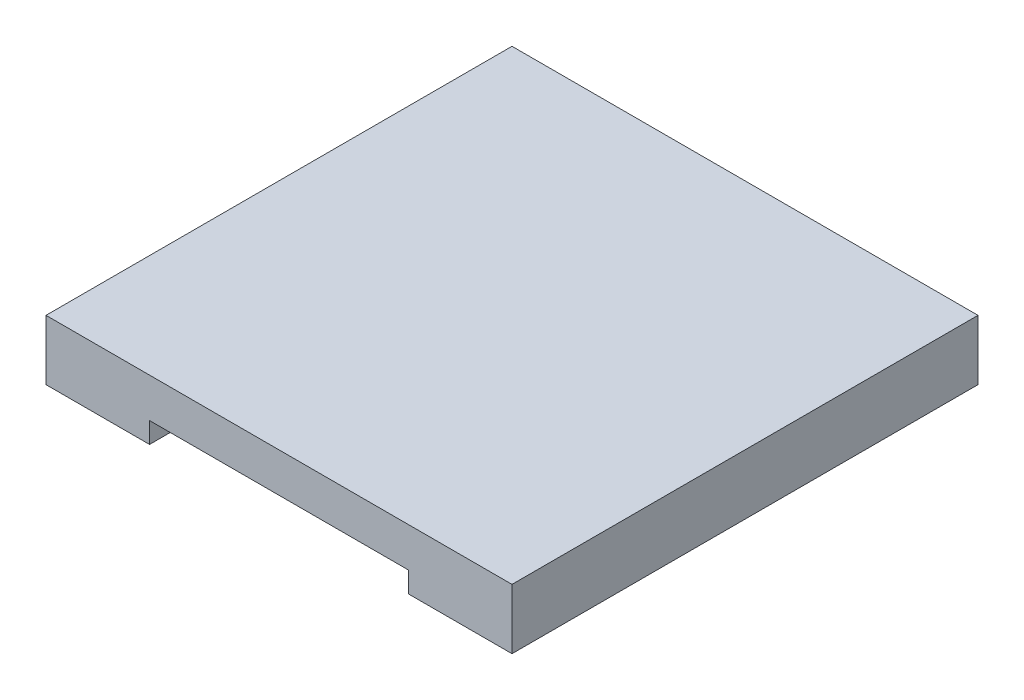
ISO-10303-21;
HEADER;
FILE_DESCRIPTION(('STEP AP214'),'2;1');
FILE_NAME('part.step','',(''),(''),'','','');
FILE_SCHEMA(('AUTOMOTIVE_DESIGN { 1 0 10303 214 1 1 1 1 }'));
ENDSEC;
DATA;
#1=APPLICATION_CONTEXT('core data for automotive mechanical design processes');
#2=APPLICATION_PROTOCOL_DEFINITION('international standard','automotive_design',2000,#1);
#3=PRODUCT_CONTEXT('',#1,'mechanical');
#4=PRODUCT('Part','Part','',(#3));
#5=PRODUCT_RELATED_PRODUCT_CATEGORY('part','',(#4));
#6=PRODUCT_DEFINITION_FORMATION('','',#4);
#7=PRODUCT_DEFINITION_CONTEXT('part definition',#1,'design');
#8=PRODUCT_DEFINITION('design','',#6,#7);
#9=PRODUCT_DEFINITION_SHAPE('','',#8);
#10=(LENGTH_UNIT() NAMED_UNIT(*) SI_UNIT(.MILLI.,.METRE.));
#11=(NAMED_UNIT(*) PLANE_ANGLE_UNIT() SI_UNIT($,.RADIAN.));
#12=(NAMED_UNIT(*) SI_UNIT($,.STERADIAN.) SOLID_ANGLE_UNIT());
#13=UNCERTAINTY_MEASURE_WITH_UNIT(LENGTH_MEASURE(1.E-05),#10,'distance_accuracy_value','');
#14=(GEOMETRIC_REPRESENTATION_CONTEXT(3) GLOBAL_UNCERTAINTY_ASSIGNED_CONTEXT((#13)) GLOBAL_UNIT_ASSIGNED_CONTEXT((#10,
#11,#12)) REPRESENTATION_CONTEXT('',''));
#15=CARTESIAN_POINT('',(0.,0.,0.));
#16=DIRECTION('',(0.,0.,1.));
#17=DIRECTION('',(1.,0.,0.));
#18=AXIS2_PLACEMENT_3D('',#15,#16,#17);
#19=CARTESIAN_POINT('',(0.,79.,0.));
#20=DIRECTION('',(0.,1.,0.));
#21=DIRECTION('',(0.,0.,1.));
#22=AXIS2_PLACEMENT_3D('',#19,#20,#21);
#23=PLANE('',#22);
#24=DIRECTION('',(-1.,0.,0.));
#25=VECTOR('',#24,1.);
#26=CARTESIAN_POINT('',(-45.,79.,-45.));
#27=LINE('',#26,#25);
#28=CARTESIAN_POINT('',(7.49999999999999,79.,-45.));
#29=VERTEX_POINT('',#28);
#30=CARTESIAN_POINT('',(-7.50000000000001,79.,-45.));
#31=VERTEX_POINT('',#30);
#32=EDGE_CURVE('E217',#29,#31,#27,.T.);
#33=ORIENTED_EDGE('',*,*,#32,.F.);
#34=DIRECTION('',(0.,0.,-1.));
#35=VECTOR('',#34,1.);
#36=CARTESIAN_POINT('',(7.49999999999999,79.,-45.));
#37=LINE('',#36,#35);
#38=CARTESIAN_POINT('',(7.49999999999999,79.,-27.2));
#39=VERTEX_POINT('',#38);
#40=EDGE_CURVE('E11',#39,#29,#37,.T.);
#41=ORIENTED_EDGE('',*,*,#40,.F.);
#42=DIRECTION('',(-1.,0.,0.));
#43=VECTOR('',#42,1.);
#44=CARTESIAN_POINT('',(45.,79.,-27.2));
#45=LINE('',#44,#43);
#46=CARTESIAN_POINT('',(-7.50000000000001,79.,-27.2));
#47=VERTEX_POINT('',#46);
#48=EDGE_CURVE('E215',#39,#47,#45,.T.);
#49=ORIENTED_EDGE('',*,*,#48,.T.);
#50=DIRECTION('',(0.,0.,1.));
#51=VECTOR('',#50,1.);
#52=CARTESIAN_POINT('',(-7.50000000000001,79.,-45.));
#53=LINE('',#52,#51);
#54=EDGE_CURVE('E225',#31,#47,#53,.T.);
#55=ORIENTED_EDGE('',*,*,#54,.F.);
#56=EDGE_LOOP('',(#33,#41,#49,#55));
#57=FACE_BOUND('',#56,.T.);
#58=DIRECTION('',(0.,0.,1.));
#59=VECTOR('',#58,1.);
#60=CARTESIAN_POINT('',(4.09999999999999,79.,-41.75));
#61=LINE('',#60,#59);
#62=CARTESIAN_POINT('',(4.09999999999999,79.,-41.75));
#63=VERTEX_POINT('',#62);
#64=CARTESIAN_POINT('',(4.09999999999999,79.,-30.45));
#65=VERTEX_POINT('',#64);
#66=EDGE_CURVE('E55',#63,#65,#61,.T.);
#67=ORIENTED_EDGE('',*,*,#66,.F.);
#68=DIRECTION('',(1.,0.,0.));
#69=VECTOR('',#68,1.);
#70=CARTESIAN_POINT('',(4.09999999999999,79.,-41.75));
#71=LINE('',#70,#69);
#72=CARTESIAN_POINT('',(-4.1,79.,-41.75));
#73=VERTEX_POINT('',#72);
#74=EDGE_CURVE('E59',#73,#63,#71,.T.);
#75=ORIENTED_EDGE('',*,*,#74,.F.);
#76=DIRECTION('',(0.,0.,-1.));
#77=VECTOR('',#76,1.);
#78=CARTESIAN_POINT('',(-4.1,79.,-41.75));
#79=LINE('',#78,#77);
#80=CARTESIAN_POINT('',(-4.1,79.,-30.45));
#81=VERTEX_POINT('',#80);
#82=EDGE_CURVE('E684',#81,#73,#79,.T.);
#83=ORIENTED_EDGE('',*,*,#82,.F.);
#84=DIRECTION('',(-1.,0.,0.));
#85=VECTOR('',#84,1.);
#86=CARTESIAN_POINT('',(4.09999999999999,79.,-30.45));
#87=LINE('',#86,#85);
#88=EDGE_CURVE('E690',#65,#81,#87,.T.);
#89=ORIENTED_EDGE('',*,*,#88,.F.);
#90=EDGE_LOOP('',(#67,#75,#83,#89));
#91=FACE_BOUND('',#90,.T.);
#92=ADVANCED_FACE('F40',(#57,#91),#23,.F.);
#93=CARTESIAN_POINT('',(0.,91.4,0.));
#94=DIRECTION('',(0.,1.,0.));
#95=DIRECTION('',(0.,0.,1.));
#96=AXIS2_PLACEMENT_3D('',#93,#94,#95);
#97=PLANE('',#96);
#98=DIRECTION('',(1.,0.,0.));
#99=VECTOR('',#98,1.);
#100=CARTESIAN_POINT('',(45.,91.4,-25.2));
#101=LINE('',#100,#99);
#102=CARTESIAN_POINT('',(25.,91.4,-25.2));
#103=VERTEX_POINT('',#102);
#104=CARTESIAN_POINT('',(25.7966933112238,91.4,-25.2));
#105=VERTEX_POINT('',#104);
#106=EDGE_CURVE('E343',#103,#105,#101,.T.);
#107=ORIENTED_EDGE('',*,*,#106,.T.);
#108=DIRECTION('',(0.,0.,1.));
#109=VECTOR('',#108,1.);
#110=CARTESIAN_POINT('',(25.7966933112238,91.4,-45.));
#111=LINE('',#110,#109);
#112=CARTESIAN_POINT('',(25.7966933112238,91.4,-45.));
#113=VERTEX_POINT('',#112);
#114=EDGE_CURVE('E312',#105,#113,#111,.F.);
#115=ORIENTED_EDGE('',*,*,#114,.T.);
#116=DIRECTION('',(-1.,0.,0.));
#117=VECTOR('',#116,1.);
#118=CARTESIAN_POINT('',(-45.,91.4,-45.));
#119=LINE('',#118,#117);
#120=CARTESIAN_POINT('',(45.,91.4,-45.));
#121=VERTEX_POINT('',#120);
#122=EDGE_CURVE('E250',#121,#113,#119,.T.);
#123=ORIENTED_EDGE('',*,*,#122,.F.);
#124=DIRECTION('',(0.,0.,-1.));
#125=VECTOR('',#124,1.);
#126=CARTESIAN_POINT('',(45.,91.4,-45.));
#127=LINE('',#126,#125);
#128=CARTESIAN_POINT('',(45.,91.4,45.));
#129=VERTEX_POINT('',#128);
#130=EDGE_CURVE('E263',#129,#121,#127,.T.);
#131=ORIENTED_EDGE('',*,*,#130,.F.);
#132=DIRECTION('',(1.,0.,0.));
#133=VECTOR('',#132,1.);
#134=CARTESIAN_POINT('',(-45.,91.4,45.));
#135=LINE('',#134,#133);
#136=CARTESIAN_POINT('',(25.,91.4,45.));
#137=VERTEX_POINT('',#136);
#138=EDGE_CURVE('E259',#137,#129,#135,.T.);
#139=ORIENTED_EDGE('',*,*,#138,.F.);
#140=DIRECTION('',(0.,0.,1.));
#141=VECTOR('',#140,1.);
#142=CARTESIAN_POINT('',(25.,91.4,-27.2));
#143=LINE('',#142,#141);
#144=EDGE_CURVE('E243',#103,#137,#143,.T.);
#145=ORIENTED_EDGE('',*,*,#144,.F.);
#146=EDGE_LOOP('',(#107,#115,#123,#131,#139,#145));
#147=FACE_BOUND('',#146,.T.);
#148=ADVANCED_FACE('F401',(#147),#97,.F.);
#149=CARTESIAN_POINT('',(-45.,4.,-45.));
#150=DIRECTION('',(0.,0.,1.));
#151=DIRECTION('',(1.,0.,0.));
#152=AXIS2_PLACEMENT_3D('',#149,#150,#151);
#153=PLANE('',#152);
#154=DIRECTION('',(0.,-1.,0.));
#155=VECTOR('',#154,1.);
#156=CARTESIAN_POINT('',(7.49999999999999,91.4,-45.));
#157=LINE('',#156,#155);
#158=CARTESIAN_POINT('',(7.49999999999999,79.6590323935863,-45.));
#159=VERTEX_POINT('',#158);
#160=EDGE_CURVE('E282',#159,#29,#157,.T.);
#161=ORIENTED_EDGE('',*,*,#160,.T.);
#162=ORIENTED_EDGE('',*,*,#32,.T.);
#163=DIRECTION('',(0.,-1.,0.));
#164=VECTOR('',#163,1.);
#165=CARTESIAN_POINT('',(-7.50000000000001,91.4,-45.));
#166=LINE('',#165,#164);
#167=CARTESIAN_POINT('',(-7.50000000000001,79.6590323935863,-45.));
#168=VERTEX_POINT('',#167);
#169=EDGE_CURVE('E279',#168,#31,#166,.T.);
#170=ORIENTED_EDGE('',*,*,#169,.F.);
#171=CARTESIAN_POINT('',(-10.5,79.6590323935863,-45.));
#172=DIRECTION('',(0.,0.,1.));
#173=DIRECTION('',(1.,0.,0.));
#174=AXIS2_PLACEMENT_3D('',#171,#172,#173);
#175=CIRCLE('',#174,3.);
#176=CARTESIAN_POINT('',(-9.01158318492949,82.2637618199597,-45.));
#177=VERTEX_POINT('',#176);
#178=EDGE_CURVE('E324',#168,#177,#175,.T.);
#179=ORIENTED_EDGE('',*,*,#178,.T.);
#180=DIRECTION('',(0.868243142124459,-0.496138938356835,0.));
#181=VECTOR('',#180,1.);
#182=CARTESIAN_POINT('',(-2.42769230769218,78.5015384615384,-45.));
#183=LINE('',#182,#181);
#184=CARTESIAN_POINT('',(-24.3082764961533,91.0047294263734,-45.));
#185=VERTEX_POINT('',#184);
#186=EDGE_CURVE('E293',#177,#185,#183,.F.);
#187=ORIENTED_EDGE('',*,*,#186,.T.);
#188=CARTESIAN_POINT('',(-25.7966933112238,88.4,-45.));
#189=DIRECTION('',(0.,0.,1.));
#190=DIRECTION('',(1.,0.,0.));
#191=AXIS2_PLACEMENT_3D('',#188,#189,#190);
#192=CIRCLE('',#191,3.);
#193=CARTESIAN_POINT('',(-25.7966933112238,91.4,-45.));
#194=VERTEX_POINT('',#193);
#195=EDGE_CURVE('E322',#185,#194,#192,.T.);
#196=ORIENTED_EDGE('',*,*,#195,.T.);
#197=CARTESIAN_POINT('',(-45.,91.4,-45.));
#198=VERTEX_POINT('',#197);
#199=EDGE_CURVE('E265',#194,#198,#119,.T.);
#200=ORIENTED_EDGE('',*,*,#199,.T.);
#201=DIRECTION('',(0.,-1.,0.));
#202=VECTOR('',#201,1.);
#203=CARTESIAN_POINT('',(-45.,103.,-45.));
#204=LINE('',#203,#202);
#205=CARTESIAN_POINT('',(-45.,103.,-45.));
#206=VERTEX_POINT('',#205);
#207=EDGE_CURVE('E256',#206,#198,#204,.T.);
#208=ORIENTED_EDGE('',*,*,#207,.F.);
#209=DIRECTION('',(-1.,0.,0.));
#210=VECTOR('',#209,1.);
#211=CARTESIAN_POINT('',(-45.,103.,-45.));
#212=LINE('',#211,#210);
#213=CARTESIAN_POINT('',(45.,103.,-45.));
#214=VERTEX_POINT('',#213);
#215=EDGE_CURVE('E254',#214,#206,#212,.T.);
#216=ORIENTED_EDGE('',*,*,#215,.F.);
#217=DIRECTION('',(0.,-1.,0.));
#218=VECTOR('',#217,1.);
#219=CARTESIAN_POINT('',(45.,103.,-45.));
#220=LINE('',#219,#218);
#221=EDGE_CURVE('E270',#214,#121,#220,.T.);
#222=ORIENTED_EDGE('',*,*,#221,.T.);
#223=ORIENTED_EDGE('',*,*,#122,.T.);
#224=CARTESIAN_POINT('',(25.7966933112238,88.4,-45.));
#225=DIRECTION('',(0.,0.,1.));
#226=DIRECTION('',(1.,0.,0.));
#227=AXIS2_PLACEMENT_3D('',#224,#225,#226);
#228=CIRCLE('',#227,3.);
#229=CARTESIAN_POINT('',(24.3082764961533,91.0047294263734,-45.));
#230=VERTEX_POINT('',#229);
#231=EDGE_CURVE('E328',#113,#230,#228,.T.);
#232=ORIENTED_EDGE('',*,*,#231,.T.);
#233=DIRECTION('',(0.868243142124459,0.496138938356835,0.));
#234=VECTOR('',#233,1.);
#235=CARTESIAN_POINT('',(-65.4184615384615,39.7323076923076,-45.));
#236=LINE('',#235,#234);
#237=CARTESIAN_POINT('',(9.01158318492949,82.2637618199597,-45.));
#238=VERTEX_POINT('',#237);
#239=EDGE_CURVE('E296',#230,#238,#236,.F.);
#240=ORIENTED_EDGE('',*,*,#239,.T.);
#241=CARTESIAN_POINT('',(10.5,79.6590323935863,-45.));
#242=DIRECTION('',(0.,0.,1.));
#243=DIRECTION('',(1.,0.,0.));
#244=AXIS2_PLACEMENT_3D('',#241,#242,#243);
#245=CIRCLE('',#244,3.);
#246=EDGE_CURVE('E332',#238,#159,#245,.T.);
#247=ORIENTED_EDGE('',*,*,#246,.T.);
#248=EDGE_LOOP('',(#161,#162,#170,#179,#187,#196,#200,#208,#216,#222,#223,#232,#240,#247));
#249=FACE_BOUND('',#248,.T.);
#250=ADVANCED_FACE('F387',(#249),#153,.F.);
#251=CARTESIAN_POINT('',(45.,41.4,-27.2));
#252=DIRECTION('',(0.,0.,1.));
#253=DIRECTION('',(1.,0.,0.));
#254=AXIS2_PLACEMENT_3D('',#251,#252,#253);
#255=PLANE('',#254);
#256=ORIENTED_EDGE('',*,*,#48,.F.);
#257=DIRECTION('',(0.,-1.,0.));
#258=VECTOR('',#257,1.);
#259=CARTESIAN_POINT('',(7.49999999999999,91.4,-27.2));
#260=LINE('',#259,#258);
#261=CARTESIAN_POINT('',(7.49999999999999,79.6590323935863,-27.2));
#262=VERTEX_POINT('',#261);
#263=EDGE_CURVE('E285',#262,#39,#260,.T.);
#264=ORIENTED_EDGE('',*,*,#263,.F.);
#265=CARTESIAN_POINT('',(10.5,79.6590323935863,-27.2));
#266=DIRECTION('',(0.,0.,1.));
#267=DIRECTION('',(1.,0.,0.));
#268=AXIS2_PLACEMENT_3D('',#265,#266,#267);
#269=CIRCLE('',#268,3.);
#270=CARTESIAN_POINT('',(9.01158318492948,82.2637618199597,-27.2));
#271=VERTEX_POINT('',#270);
#272=EDGE_CURVE('E330',#262,#271,#269,.F.);
#273=ORIENTED_EDGE('',*,*,#272,.T.);
#274=DIRECTION('',(-0.868243142124459,-0.496138938356835,0.));
#275=VECTOR('',#274,1.);
#276=CARTESIAN_POINT('',(24.9999999999999,91.4,-27.2));
#277=LINE('',#276,#275);
#278=CARTESIAN_POINT('',(23.2499999999999,90.4,-27.2));
#279=VERTEX_POINT('',#278);
#280=EDGE_CURVE('E299',#271,#279,#277,.F.);
#281=ORIENTED_EDGE('',*,*,#280,.T.);
#282=DIRECTION('',(-1.,0.,0.));
#283=VECTOR('',#282,1.);
#284=CARTESIAN_POINT('',(45.,90.4,-27.2));
#285=LINE('',#284,#283);
#286=CARTESIAN_POINT('',(-23.2499999999999,90.4,-27.2));
#287=VERTEX_POINT('',#286);
#288=EDGE_CURVE('E334',#279,#287,#285,.T.);
#289=ORIENTED_EDGE('',*,*,#288,.T.);
#290=DIRECTION('',(-0.868243142124459,0.496138938356835,0.));
#291=VECTOR('',#290,1.);
#292=CARTESIAN_POINT('',(-24.9999999999999,91.4,-27.2));
#293=LINE('',#292,#291);
#294=CARTESIAN_POINT('',(-9.0115831849295,82.2637618199597,-27.2));
#295=VERTEX_POINT('',#294);
#296=EDGE_CURVE('E291',#287,#295,#293,.F.);
#297=ORIENTED_EDGE('',*,*,#296,.T.);
#298=CARTESIAN_POINT('',(-10.5,79.6590323935863,-27.2));
#299=DIRECTION('',(0.,0.,1.));
#300=DIRECTION('',(1.,0.,0.));
#301=AXIS2_PLACEMENT_3D('',#298,#299,#300);
#302=CIRCLE('',#301,3.);
#303=CARTESIAN_POINT('',(-7.5,79.6590323935863,-27.2));
#304=VERTEX_POINT('',#303);
#305=EDGE_CURVE('E326',#295,#304,#302,.F.);
#306=ORIENTED_EDGE('',*,*,#305,.T.);
#307=DIRECTION('',(0.,-1.,0.));
#308=VECTOR('',#307,1.);
#309=CARTESIAN_POINT('',(-7.5,91.4,-27.2));
#310=LINE('',#309,#308);
#311=EDGE_CURVE('E288',#304,#47,#310,.T.);
#312=ORIENTED_EDGE('',*,*,#311,.T.);
#313=EDGE_LOOP('',(#256,#264,#273,#281,#289,#297,#306,#312));
#314=FACE_BOUND('',#313,.T.);
#315=ADVANCED_FACE('F368',(#314),#255,.T.);
#316=CARTESIAN_POINT('',(-7.50000000000001,91.4,-45.));
#317=DIRECTION('',(1.,0.,0.));
#318=DIRECTION('',(0.,0.,-1.));
#319=AXIS2_PLACEMENT_3D('',#316,#317,#318);
#320=PLANE('',#319);
#321=ORIENTED_EDGE('',*,*,#169,.T.);
#322=ORIENTED_EDGE('',*,*,#54,.T.);
#323=ORIENTED_EDGE('',*,*,#311,.F.);
#324=DIRECTION('',(0.,0.,1.));
#325=VECTOR('',#324,1.);
#326=CARTESIAN_POINT('',(-7.50000000000001,79.6590323935863,-45.));
#327=LINE('',#326,#325);
#328=EDGE_CURVE('E309',#304,#168,#327,.F.);
#329=ORIENTED_EDGE('',*,*,#328,.T.);
#330=EDGE_LOOP('',(#321,#322,#323,#329));
#331=FACE_BOUND('',#330,.T.);
#332=ADVANCED_FACE('F383',(#331),#320,.F.);
#333=CARTESIAN_POINT('',(7.49999999999999,91.4,-45.));
#334=DIRECTION('',(-1.,0.,0.));
#335=DIRECTION('',(0.,0.,1.));
#336=AXIS2_PLACEMENT_3D('',#333,#334,#335);
#337=PLANE('',#336);
#338=ORIENTED_EDGE('',*,*,#263,.T.);
#339=ORIENTED_EDGE('',*,*,#40,.T.);
#340=ORIENTED_EDGE('',*,*,#160,.F.);
#341=DIRECTION('',(0.,0.,-1.));
#342=VECTOR('',#341,1.);
#343=CARTESIAN_POINT('',(7.49999999999999,79.6590323935863,-27.2));
#344=LINE('',#343,#342);
#345=EDGE_CURVE('E319',#159,#262,#344,.F.);
#346=ORIENTED_EDGE('',*,*,#345,.T.);
#347=EDGE_LOOP('',(#338,#339,#340,#346));
#348=FACE_BOUND('',#347,.T.);
#349=ADVANCED_FACE('F392',(#348),#337,.F.);
#350=DIRECTION('',(0.,0.,-1.));
#351=VECTOR('',#350,1.);
#352=CARTESIAN_POINT('',(-25.7966933112238,91.4,-27.2));
#353=LINE('',#352,#351);
#354=CARTESIAN_POINT('',(-25.7966933112238,91.4,-25.2));
#355=VERTEX_POINT('',#354);
#356=EDGE_CURVE('E302',#194,#355,#353,.F.);
#357=ORIENTED_EDGE('',*,*,#356,.T.);
#358=DIRECTION('',(1.,0.,0.));
#359=VECTOR('',#358,1.);
#360=CARTESIAN_POINT('',(45.,91.4,-25.2));
#361=LINE('',#360,#359);
#362=CARTESIAN_POINT('',(-25.,91.4,-25.2));
#363=VERTEX_POINT('',#362);
#364=EDGE_CURVE('E337',#355,#363,#361,.T.);
#365=ORIENTED_EDGE('',*,*,#364,.T.);
#366=DIRECTION('',(0.,0.,1.));
#367=VECTOR('',#366,1.);
#368=CARTESIAN_POINT('',(-25.,91.4,-27.2));
#369=LINE('',#368,#367);
#370=CARTESIAN_POINT('',(-25.,91.4,45.));
#371=VERTEX_POINT('',#370);
#372=EDGE_CURVE('E237',#363,#371,#369,.T.);
#373=ORIENTED_EDGE('',*,*,#372,.T.);
#374=CARTESIAN_POINT('',(-45.,91.4,45.));
#375=VERTEX_POINT('',#374);
#376=EDGE_CURVE('E260',#375,#371,#135,.T.);
#377=ORIENTED_EDGE('',*,*,#376,.F.);
#378=DIRECTION('',(0.,0.,1.));
#379=VECTOR('',#378,1.);
#380=CARTESIAN_POINT('',(-45.,91.4,-45.));
#381=LINE('',#380,#379);
#382=EDGE_CURVE('E240',#198,#375,#381,.T.);
#383=ORIENTED_EDGE('',*,*,#382,.F.);
#384=ORIENTED_EDGE('',*,*,#199,.F.);
#385=EDGE_LOOP('',(#357,#365,#373,#377,#383,#384));
#386=FACE_BOUND('',#385,.T.);
#387=ADVANCED_FACE('F421',(#386),#97,.F.);
#388=CARTESIAN_POINT('',(-45.,103.,-45.));
#389=DIRECTION('',(1.,0.,0.));
#390=DIRECTION('',(0.,0.,-1.));
#391=AXIS2_PLACEMENT_3D('',#388,#389,#390);
#392=PLANE('',#391);
#393=ORIENTED_EDGE('',*,*,#382,.T.);
#394=DIRECTION('',(0.,-1.,0.));
#395=VECTOR('',#394,1.);
#396=CARTESIAN_POINT('',(-45.,103.,45.));
#397=LINE('',#396,#395);
#398=CARTESIAN_POINT('',(-45.,103.,45.));
#399=VERTEX_POINT('',#398);
#400=EDGE_CURVE('E276',#399,#375,#397,.T.);
#401=ORIENTED_EDGE('',*,*,#400,.F.);
#402=DIRECTION('',(0.,0.,1.));
#403=VECTOR('',#402,1.);
#404=CARTESIAN_POINT('',(-45.,103.,-45.));
#405=LINE('',#404,#403);
#406=EDGE_CURVE('E246',#206,#399,#405,.T.);
#407=ORIENTED_EDGE('',*,*,#406,.F.);
#408=ORIENTED_EDGE('',*,*,#207,.T.);
#409=EDGE_LOOP('',(#393,#401,#407,#408));
#410=FACE_BOUND('',#409,.T.);
#411=ADVANCED_FACE('F431',(#410),#392,.F.);
#412=CARTESIAN_POINT('',(-45.,103.,45.));
#413=DIRECTION('',(0.,0.,-1.));
#414=DIRECTION('',(-1.,0.,0.));
#415=AXIS2_PLACEMENT_3D('',#412,#413,#414);
#416=PLANE('',#415);
#417=ORIENTED_EDGE('',*,*,#376,.T.);
#418=DIRECTION('',(0.,-1.,0.));
#419=VECTOR('',#418,1.);
#420=CARTESIAN_POINT('',(-25.,91.4,45.));
#421=LINE('',#420,#419);
#422=CARTESIAN_POINT('',(-25.,95.4,45.));
#423=VERTEX_POINT('',#422);
#424=EDGE_CURVE('E228',#423,#371,#421,.T.);
#425=ORIENTED_EDGE('',*,*,#424,.F.);
#426=DIRECTION('',(-1.,0.,0.));
#427=VECTOR('',#426,1.);
#428=CARTESIAN_POINT('',(-25.,95.4,45.));
#429=LINE('',#428,#427);
#430=CARTESIAN_POINT('',(25.,95.4,45.));
#431=VERTEX_POINT('',#430);
#432=EDGE_CURVE('E234',#431,#423,#429,.T.);
#433=ORIENTED_EDGE('',*,*,#432,.F.);
#434=DIRECTION('',(0.,1.,0.));
#435=VECTOR('',#434,1.);
#436=CARTESIAN_POINT('',(25.,91.4,45.));
#437=LINE('',#436,#435);
#438=EDGE_CURVE('E231',#137,#431,#437,.T.);
#439=ORIENTED_EDGE('',*,*,#438,.F.);
#440=ORIENTED_EDGE('',*,*,#138,.T.);
#441=DIRECTION('',(0.,-1.,0.));
#442=VECTOR('',#441,1.);
#443=CARTESIAN_POINT('',(45.,103.,45.));
#444=LINE('',#443,#442);
#445=CARTESIAN_POINT('',(45.,103.,45.));
#446=VERTEX_POINT('',#445);
#447=EDGE_CURVE('E273',#446,#129,#444,.T.);
#448=ORIENTED_EDGE('',*,*,#447,.F.);
#449=DIRECTION('',(1.,0.,0.));
#450=VECTOR('',#449,1.);
#451=CARTESIAN_POINT('',(-45.,103.,45.));
#452=LINE('',#451,#450);
#453=EDGE_CURVE('E249',#399,#446,#452,.T.);
#454=ORIENTED_EDGE('',*,*,#453,.F.);
#455=ORIENTED_EDGE('',*,*,#400,.T.);
#456=EDGE_LOOP('',(#417,#425,#433,#439,#440,#448,#454,#455));
#457=FACE_BOUND('',#456,.T.);
#458=ADVANCED_FACE('F434',(#457),#416,.F.);
#459=CARTESIAN_POINT('',(45.,103.,-45.));
#460=DIRECTION('',(-1.,0.,0.));
#461=DIRECTION('',(0.,0.,1.));
#462=AXIS2_PLACEMENT_3D('',#459,#460,#461);
#463=PLANE('',#462);
#464=ORIENTED_EDGE('',*,*,#130,.T.);
#465=ORIENTED_EDGE('',*,*,#221,.F.);
#466=DIRECTION('',(0.,0.,-1.));
#467=VECTOR('',#466,1.);
#468=CARTESIAN_POINT('',(45.,103.,-45.));
#469=LINE('',#468,#467);
#470=EDGE_CURVE('E252',#446,#214,#469,.T.);
#471=ORIENTED_EDGE('',*,*,#470,.F.);
#472=ORIENTED_EDGE('',*,*,#447,.T.);
#473=EDGE_LOOP('',(#464,#465,#471,#472));
#474=FACE_BOUND('',#473,.T.);
#475=ADVANCED_FACE('F441',(#474),#463,.F.);
#476=CARTESIAN_POINT('',(0.,103.,0.));
#477=DIRECTION('',(0.,1.,0.));
#478=DIRECTION('',(0.,0.,1.));
#479=AXIS2_PLACEMENT_3D('',#476,#477,#478);
#480=PLANE('',#479);
#481=ORIENTED_EDGE('',*,*,#406,.T.);
#482=ORIENTED_EDGE('',*,*,#453,.T.);
#483=ORIENTED_EDGE('',*,*,#470,.T.);
#484=ORIENTED_EDGE('',*,*,#215,.T.);
#485=EDGE_LOOP('',(#481,#482,#483,#484));
#486=FACE_BOUND('',#485,.T.);
#487=ADVANCED_FACE('F438',(#486),#480,.T.);
#488=CARTESIAN_POINT('',(-25.,91.4,-27.2));
#489=DIRECTION('',(-1.,0.,0.));
#490=DIRECTION('',(0.,-1.,0.));
#491=AXIS2_PLACEMENT_3D('',#488,#489,#490);
#492=PLANE('',#491);
#493=ORIENTED_EDGE('',*,*,#372,.F.);
#494=DIRECTION('',(0.,0.44721359549996,0.894427190999915));
#495=VECTOR('',#494,1.);
#496=CARTESIAN_POINT('',(-25.,90.4,-27.2));
#497=LINE('',#496,#495);
#498=CARTESIAN_POINT('',(-25.,95.4,-17.2000000000001));
#499=VERTEX_POINT('',#498);
#500=EDGE_CURVE('E339',#363,#499,#497,.T.);
#501=ORIENTED_EDGE('',*,*,#500,.T.);
#502=DIRECTION('',(0.,0.,1.));
#503=VECTOR('',#502,1.);
#504=CARTESIAN_POINT('',(-25.,95.4,-27.2));
#505=LINE('',#504,#503);
#506=EDGE_CURVE('E238',#499,#423,#505,.T.);
#507=ORIENTED_EDGE('',*,*,#506,.T.);
#508=ORIENTED_EDGE('',*,*,#424,.T.);
#509=EDGE_LOOP('',(#493,#501,#507,#508));
#510=FACE_BOUND('',#509,.T.);
#511=ADVANCED_FACE('F419',(#510),#492,.F.);
#512=CARTESIAN_POINT('',(-25.,95.4,-27.2));
#513=DIRECTION('',(0.,1.,0.));
#514=DIRECTION('',(0.,0.,1.));
#515=AXIS2_PLACEMENT_3D('',#512,#513,#514);
#516=PLANE('',#515);
#517=ORIENTED_EDGE('',*,*,#506,.F.);
#518=DIRECTION('',(1.,0.,0.));
#519=VECTOR('',#518,1.);
#520=CARTESIAN_POINT('',(-25.,95.4,-17.2000000000001));
#521=LINE('',#520,#519);
#522=CARTESIAN_POINT('',(25.,95.4,-17.2000000000001));
#523=VERTEX_POINT('',#522);
#524=EDGE_CURVE('E341',#499,#523,#521,.T.);
#525=ORIENTED_EDGE('',*,*,#524,.T.);
#526=DIRECTION('',(0.,0.,1.));
#527=VECTOR('',#526,1.);
#528=CARTESIAN_POINT('',(25.,95.4,-27.2));
#529=LINE('',#528,#527);
#530=EDGE_CURVE('E241',#523,#431,#529,.T.);
#531=ORIENTED_EDGE('',*,*,#530,.T.);
#532=ORIENTED_EDGE('',*,*,#432,.T.);
#533=EDGE_LOOP('',(#517,#525,#531,#532));
#534=FACE_BOUND('',#533,.T.);
#535=ADVANCED_FACE('F415',(#534),#516,.F.);
#536=CARTESIAN_POINT('',(25.,91.4,-27.2));
#537=DIRECTION('',(1.,0.,0.));
#538=DIRECTION('',(0.,0.,-1.));
#539=AXIS2_PLACEMENT_3D('',#536,#537,#538);
#540=PLANE('',#539);
#541=ORIENTED_EDGE('',*,*,#530,.F.);
#542=DIRECTION('',(0.,-0.44721359549996,-0.894427190999915));
#543=VECTOR('',#542,1.);
#544=CARTESIAN_POINT('',(25.,90.4,-27.2));
#545=LINE('',#544,#543);
#546=EDGE_CURVE('E346',#523,#103,#545,.T.);
#547=ORIENTED_EDGE('',*,*,#546,.T.);
#548=ORIENTED_EDGE('',*,*,#144,.T.);
#549=ORIENTED_EDGE('',*,*,#438,.T.);
#550=EDGE_LOOP('',(#541,#547,#548,#549));
#551=FACE_BOUND('',#550,.T.);
#552=ADVANCED_FACE('F410',(#551),#540,.F.);
#553=CARTESIAN_POINT('',(-24.9999999999999,91.4,0.));
#554=DIRECTION('',(-0.496138938356835,-0.868243142124459,0.));
#555=DIRECTION('',(0.,0.,-1.));
#556=AXIS2_PLACEMENT_3D('',#553,#554,#555);
#557=PLANE('',#556);
#558=ORIENTED_EDGE('',*,*,#296,.F.);
#559=DIRECTION('',(0.616315634427937,-0.352180362530251,-0.704360725060498));
#560=VECTOR('',#559,1.);
#561=CARTESIAN_POINT('',(-35.9395348837208,97.6511627906977,-12.6976744186047));
#562=LINE('',#561,#560);
#563=CARTESIAN_POINT('',(-24.3082764961533,91.0047294263734,-25.9905411472532));
#564=VERTEX_POINT('',#563);
#565=EDGE_CURVE('E348',#287,#564,#562,.F.);
#566=ORIENTED_EDGE('',*,*,#565,.T.);
#567=DIRECTION('',(0.,0.,1.));
#568=VECTOR('',#567,1.);
#569=CARTESIAN_POINT('',(-24.3082764961533,91.0047294263734,-45.));
#570=LINE('',#569,#568);
#571=EDGE_CURVE('E307',#564,#185,#570,.F.);
#572=ORIENTED_EDGE('',*,*,#571,.T.);
#573=ORIENTED_EDGE('',*,*,#186,.F.);
#574=DIRECTION('',(0.,0.,-1.));
#575=VECTOR('',#574,1.);
#576=CARTESIAN_POINT('',(-9.0115831849295,82.2637618199597,-27.2));
#577=LINE('',#576,#575);
#578=EDGE_CURVE('E304',#177,#295,#577,.F.);
#579=ORIENTED_EDGE('',*,*,#578,.T.);
#580=EDGE_LOOP('',(#558,#566,#572,#573,#579));
#581=FACE_BOUND('',#580,.T.);
#582=ADVANCED_FACE('F375',(#581),#557,.T.);
#583=CARTESIAN_POINT('',(24.9999999999999,91.4,0.));
#584=DIRECTION('',(0.496138938356835,-0.868243142124459,0.));
#585=DIRECTION('',(0.,0.,1.));
#586=AXIS2_PLACEMENT_3D('',#583,#584,#585);
#587=PLANE('',#586);
#588=ORIENTED_EDGE('',*,*,#239,.F.);
#589=DIRECTION('',(0.,0.,-1.));
#590=VECTOR('',#589,1.);
#591=CARTESIAN_POINT('',(24.3082764961533,91.0047294263734,-27.2));
#592=LINE('',#591,#590);
#593=CARTESIAN_POINT('',(24.3082764961533,91.0047294263734,-25.9905411472533));
#594=VERTEX_POINT('',#593);
#595=EDGE_CURVE('E317',#230,#594,#592,.F.);
#596=ORIENTED_EDGE('',*,*,#595,.T.);
#597=DIRECTION('',(0.616315634427937,0.352180362530251,0.704360725060498));
#598=VECTOR('',#597,1.);
#599=CARTESIAN_POINT('',(35.9395348837208,97.6511627906977,-12.6976744186047));
#600=LINE('',#599,#598);
#601=EDGE_CURVE('E48',#594,#279,#600,.F.);
#602=ORIENTED_EDGE('',*,*,#601,.T.);
#603=ORIENTED_EDGE('',*,*,#280,.F.);
#604=DIRECTION('',(0.,0.,1.));
#605=VECTOR('',#604,1.);
#606=CARTESIAN_POINT('',(9.01158318492948,82.2637618199597,-45.));
#607=LINE('',#606,#605);
#608=EDGE_CURVE('E315',#271,#238,#607,.F.);
#609=ORIENTED_EDGE('',*,*,#608,.T.);
#610=EDGE_LOOP('',(#588,#596,#602,#603,#609));
#611=FACE_BOUND('',#610,.T.);
#612=ADVANCED_FACE('F360',(#611),#587,.T.);
#613=CARTESIAN_POINT('',(-25.7966933112238,88.4,0.));
#614=DIRECTION('',(0.,0.,1.));
#615=DIRECTION('',(1.,0.,0.));
#616=AXIS2_PLACEMENT_3D('',#613,#614,#615);
#617=CYLINDRICAL_SURFACE('',#616,3.);
#618=ORIENTED_EDGE('',*,*,#195,.F.);
#619=ORIENTED_EDGE('',*,*,#571,.F.);
#620=CARTESIAN_POINT('',(-25.7966933112238,88.4,-31.2));
#621=DIRECTION('',(0.,0.894427190999915,-0.44721359549996));
#622=DIRECTION('',(0.,0.44721359549996,0.894427190999915));
#623=AXIS2_PLACEMENT_3D('',#620,#621,#622);
#624=ELLIPSE('',#623,6.70820393249934,3.);
#625=EDGE_CURVE('E351',#564,#355,#624,.F.);
#626=ORIENTED_EDGE('',*,*,#625,.T.);
#627=ORIENTED_EDGE('',*,*,#356,.F.);
#628=EDGE_LOOP('',(#618,#619,#626,#627));
#629=FACE_BOUND('',#628,.T.);
#630=ADVANCED_FACE('F426',(#629),#617,.F.);
#631=CARTESIAN_POINT('',(-10.5,79.6590323935863,-45.));
#632=DIRECTION('',(0.,0.,-1.));
#633=DIRECTION('',(-1.,0.,0.));
#634=AXIS2_PLACEMENT_3D('',#631,#632,#633);
#635=CYLINDRICAL_SURFACE('',#634,3.);
#636=ORIENTED_EDGE('',*,*,#305,.F.);
#637=ORIENTED_EDGE('',*,*,#578,.F.);
#638=ORIENTED_EDGE('',*,*,#178,.F.);
#639=ORIENTED_EDGE('',*,*,#328,.F.);
#640=EDGE_LOOP('',(#636,#637,#638,#639));
#641=FACE_BOUND('',#640,.T.);
#642=ADVANCED_FACE('F385',(#641),#635,.F.);
#643=CARTESIAN_POINT('',(25.7966933112238,88.4,0.));
#644=DIRECTION('',(0.,0.,-1.));
#645=DIRECTION('',(-1.,0.,0.));
#646=AXIS2_PLACEMENT_3D('',#643,#644,#645);
#647=CYLINDRICAL_SURFACE('',#646,3.);
#648=ORIENTED_EDGE('',*,*,#114,.F.);
#649=CARTESIAN_POINT('',(25.7966933112238,88.4,-31.2));
#650=DIRECTION('',(0.,0.894427190999915,-0.44721359549996));
#651=DIRECTION('',(0.,-0.44721359549996,-0.894427190999915));
#652=AXIS2_PLACEMENT_3D('',#649,#650,#651);
#653=ELLIPSE('',#652,6.70820393249934,3.);
#654=EDGE_CURVE('E354',#105,#594,#653,.F.);
#655=ORIENTED_EDGE('',*,*,#654,.T.);
#656=ORIENTED_EDGE('',*,*,#595,.F.);
#657=ORIENTED_EDGE('',*,*,#231,.F.);
#658=EDGE_LOOP('',(#648,#655,#656,#657));
#659=FACE_BOUND('',#658,.T.);
#660=ADVANCED_FACE('F399',(#659),#647,.F.);
#661=CARTESIAN_POINT('',(10.5,79.6590323935863,-45.));
#662=DIRECTION('',(0.,0.,1.));
#663=DIRECTION('',(1.,0.,0.));
#664=AXIS2_PLACEMENT_3D('',#661,#662,#663);
#665=CYLINDRICAL_SURFACE('',#664,3.);
#666=ORIENTED_EDGE('',*,*,#246,.F.);
#667=ORIENTED_EDGE('',*,*,#608,.F.);
#668=ORIENTED_EDGE('',*,*,#272,.F.);
#669=ORIENTED_EDGE('',*,*,#345,.F.);
#670=EDGE_LOOP('',(#666,#667,#668,#669));
#671=FACE_BOUND('',#670,.T.);
#672=ADVANCED_FACE('F396',(#671),#665,.F.);
#673=CARTESIAN_POINT('',(45.,90.4,-27.2));
#674=DIRECTION('',(0.,0.894427190999915,-0.44721359549996));
#675=DIRECTION('',(-1.,0.,0.));
#676=AXIS2_PLACEMENT_3D('',#673,#674,#675);
#677=PLANE('',#676);
#678=ORIENTED_EDGE('',*,*,#546,.F.);
#679=ORIENTED_EDGE('',*,*,#524,.F.);
#680=ORIENTED_EDGE('',*,*,#500,.F.);
#681=ORIENTED_EDGE('',*,*,#364,.F.);
#682=ORIENTED_EDGE('',*,*,#625,.F.);
#683=ORIENTED_EDGE('',*,*,#565,.F.);
#684=ORIENTED_EDGE('',*,*,#288,.F.);
#685=ORIENTED_EDGE('',*,*,#601,.F.);
#686=ORIENTED_EDGE('',*,*,#654,.F.);
#687=ORIENTED_EDGE('',*,*,#106,.F.);
#688=EDGE_LOOP('',(#678,#679,#680,#681,#682,#683,#684,#685,#686,#687));
#689=FACE_BOUND('',#688,.T.);
#690=ADVANCED_FACE('F42',(#689),#677,.F.);
#691=CARTESIAN_POINT('',(4.09999999999999,64.,-41.75));
#692=DIRECTION('',(-1.,0.,0.));
#693=DIRECTION('',(0.,0.,1.));
#694=AXIS2_PLACEMENT_3D('',#691,#692,#693);
#695=PLANE('',#694);
#696=ORIENTED_EDGE('',*,*,#66,.T.);
#697=DIRECTION('',(0.,1.,0.));
#698=VECTOR('',#697,1.);
#699=CARTESIAN_POINT('',(4.09999999999999,64.,-30.45));
#700=LINE('',#699,#698);
#701=CARTESIAN_POINT('',(4.09999999999999,64.,-30.45));
#702=VERTEX_POINT('',#701);
#703=EDGE_CURVE('E198',#702,#65,#700,.T.);
#704=ORIENTED_EDGE('',*,*,#703,.F.);
#705=DIRECTION('',(0.,0.,1.));
#706=VECTOR('',#705,1.);
#707=CARTESIAN_POINT('',(4.09999999999999,64.,-41.75));
#708=LINE('',#707,#706);
#709=CARTESIAN_POINT('',(4.09999999999999,64.,-41.75));
#710=VERTEX_POINT('',#709);
#711=EDGE_CURVE('E204',#710,#702,#708,.T.);
#712=ORIENTED_EDGE('',*,*,#711,.F.);
#713=DIRECTION('',(0.,1.,0.));
#714=VECTOR('',#713,1.);
#715=CARTESIAN_POINT('',(4.09999999999999,64.,-41.75));
#716=LINE('',#715,#714);
#717=EDGE_CURVE('E682',#710,#63,#716,.T.);
#718=ORIENTED_EDGE('',*,*,#717,.T.);
#719=EDGE_LOOP('',(#696,#704,#712,#718));
#720=FACE_BOUND('',#719,.T.);
#721=ADVANCED_FACE('F214',(#720),#695,.F.);
#722=CARTESIAN_POINT('',(4.09999999999999,64.,-30.45));
#723=DIRECTION('',(0.,0.,-1.));
#724=DIRECTION('',(-1.,0.,0.));
#725=AXIS2_PLACEMENT_3D('',#722,#723,#724);
#726=PLANE('',#725);
#727=ORIENTED_EDGE('',*,*,#88,.T.);
#728=DIRECTION('',(0.,1.,0.));
#729=VECTOR('',#728,1.);
#730=CARTESIAN_POINT('',(-4.1,64.,-30.45));
#731=LINE('',#730,#729);
#732=CARTESIAN_POINT('',(-4.1,64.,-30.45));
#733=VERTEX_POINT('',#732);
#734=EDGE_CURVE('E200',#733,#81,#731,.T.);
#735=ORIENTED_EDGE('',*,*,#734,.F.);
#736=DIRECTION('',(-1.,0.,0.));
#737=VECTOR('',#736,1.);
#738=CARTESIAN_POINT('',(4.09999999999999,64.,-30.45));
#739=LINE('',#738,#737);
#740=EDGE_CURVE('E193',#702,#733,#739,.T.);
#741=ORIENTED_EDGE('',*,*,#740,.F.);
#742=ORIENTED_EDGE('',*,*,#703,.T.);
#743=EDGE_LOOP('',(#727,#735,#741,#742));
#744=FACE_BOUND('',#743,.T.);
#745=ADVANCED_FACE('F196',(#744),#726,.F.);
#746=CARTESIAN_POINT('',(-4.1,64.,-41.75));
#747=DIRECTION('',(1.,0.,0.));
#748=DIRECTION('',(0.,0.,-1.));
#749=AXIS2_PLACEMENT_3D('',#746,#747,#748);
#750=PLANE('',#749);
#751=ORIENTED_EDGE('',*,*,#82,.T.);
#752=DIRECTION('',(0.,1.,0.));
#753=VECTOR('',#752,1.);
#754=CARTESIAN_POINT('',(-4.1,64.,-41.75));
#755=LINE('',#754,#753);
#756=CARTESIAN_POINT('',(-4.1,64.,-41.75));
#757=VERTEX_POINT('',#756);
#758=EDGE_CURVE('E219',#757,#73,#755,.T.);
#759=ORIENTED_EDGE('',*,*,#758,.F.);
#760=DIRECTION('',(0.,0.,-1.));
#761=VECTOR('',#760,1.);
#762=CARTESIAN_POINT('',(-4.1,64.,-41.75));
#763=LINE('',#762,#761);
#764=EDGE_CURVE('E203',#733,#757,#763,.T.);
#765=ORIENTED_EDGE('',*,*,#764,.F.);
#766=ORIENTED_EDGE('',*,*,#734,.T.);
#767=EDGE_LOOP('',(#751,#759,#765,#766));
#768=FACE_BOUND('',#767,.T.);
#769=ADVANCED_FACE('F499',(#768),#750,.F.);
#770=CARTESIAN_POINT('',(4.09999999999999,64.,-41.75));
#771=DIRECTION('',(0.,0.,1.));
#772=DIRECTION('',(1.,0.,0.));
#773=AXIS2_PLACEMENT_3D('',#770,#771,#772);
#774=PLANE('',#773);
#775=ORIENTED_EDGE('',*,*,#74,.T.);
#776=ORIENTED_EDGE('',*,*,#717,.F.);
#777=DIRECTION('',(1.,0.,0.));
#778=VECTOR('',#777,1.);
#779=CARTESIAN_POINT('',(4.09999999999999,64.,-41.75));
#780=LINE('',#779,#778);
#781=EDGE_CURVE('E209',#757,#710,#780,.T.);
#782=ORIENTED_EDGE('',*,*,#781,.F.);
#783=ORIENTED_EDGE('',*,*,#758,.T.);
#784=EDGE_LOOP('',(#775,#776,#782,#783));
#785=FACE_BOUND('',#784,.T.);
#786=ADVANCED_FACE('F503',(#785),#774,.F.);
#787=CARTESIAN_POINT('',(0.,64.,0.));
#788=DIRECTION('',(0.,-1.,0.));
#789=DIRECTION('',(0.,0.,-1.));
#790=AXIS2_PLACEMENT_3D('',#787,#788,#789);
#791=PLANE('',#790);
#792=ORIENTED_EDGE('',*,*,#711,.T.);
#793=ORIENTED_EDGE('',*,*,#740,.T.);
#794=ORIENTED_EDGE('',*,*,#764,.T.);
#795=ORIENTED_EDGE('',*,*,#781,.T.);
#796=EDGE_LOOP('',(#792,#793,#794,#795));
#797=FACE_BOUND('',#796,.T.);
#798=ADVANCED_FACE('F207',(#797),#791,.T.);
#799=CLOSED_SHELL('',(#92,#148,#250,#315,#332,#349,#387,#411,#458,#475,#487,#511,#535,#552,#582,
#612,#630,#642,#660,#672,#690,#721,#745,#769,#786,#798));
#800=MANIFOLD_SOLID_BREP('B2',#799);
#801=ADVANCED_BREP_SHAPE_REPRESENTATION('',(#18,#800),#14);
#802=SHAPE_DEFINITION_REPRESENTATION(#9,#801);
ENDSEC;
END-ISO-10303-21;
